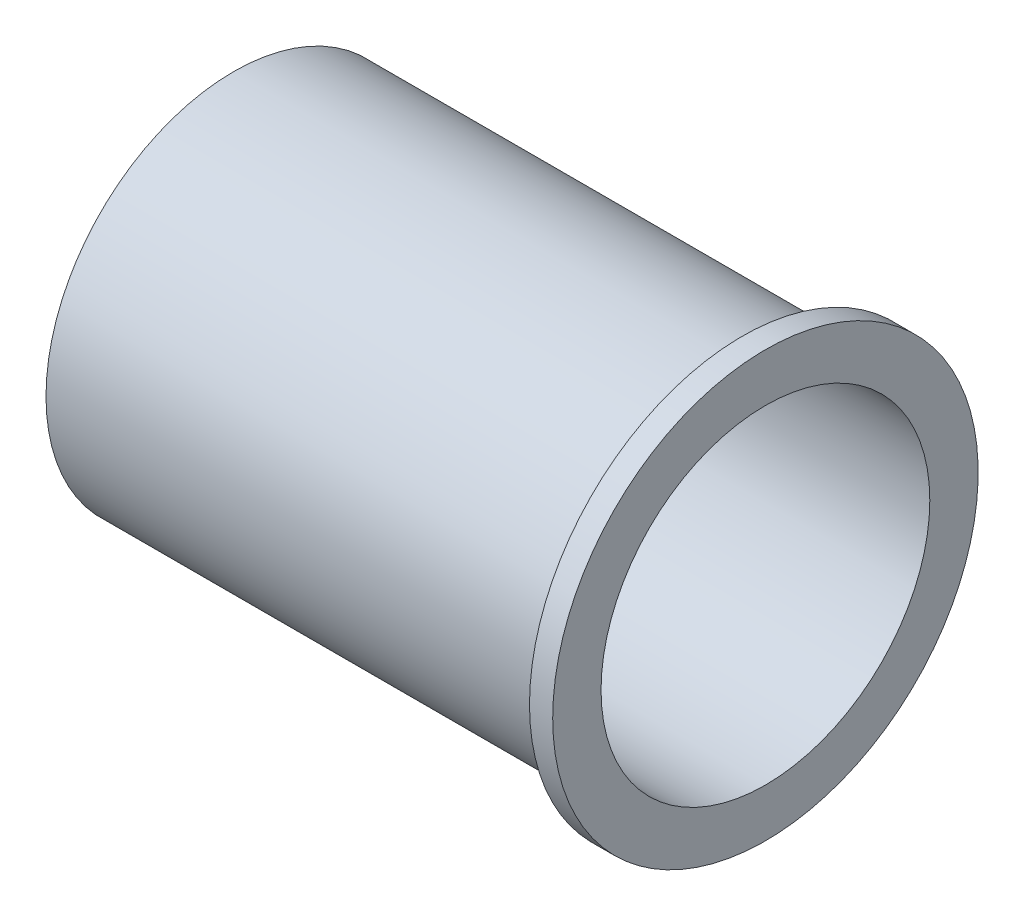
ISO-10303-21;
HEADER;
FILE_DESCRIPTION(('STEP AP214'),'2;1');
FILE_NAME('part.step','',(''),(''),'','','');
FILE_SCHEMA(('AUTOMOTIVE_DESIGN { 1 0 10303 214 1 1 1 1 }'));
ENDSEC;
DATA;
#1=APPLICATION_CONTEXT('core data for automotive mechanical design processes');
#2=APPLICATION_PROTOCOL_DEFINITION('international standard','automotive_design',2000,#1);
#3=PRODUCT_CONTEXT('',#1,'mechanical');
#4=PRODUCT('Part','Part','',(#3));
#5=PRODUCT_RELATED_PRODUCT_CATEGORY('part','',(#4));
#6=PRODUCT_DEFINITION_FORMATION('','',#4);
#7=PRODUCT_DEFINITION_CONTEXT('part definition',#1,'design');
#8=PRODUCT_DEFINITION('design','',#6,#7);
#9=PRODUCT_DEFINITION_SHAPE('','',#8);
#10=(LENGTH_UNIT() NAMED_UNIT(*) SI_UNIT(.MILLI.,.METRE.));
#11=(NAMED_UNIT(*) PLANE_ANGLE_UNIT() SI_UNIT($,.RADIAN.));
#12=(NAMED_UNIT(*) SI_UNIT($,.STERADIAN.) SOLID_ANGLE_UNIT());
#13=UNCERTAINTY_MEASURE_WITH_UNIT(LENGTH_MEASURE(1.E-05),#10,'distance_accuracy_value','');
#14=(GEOMETRIC_REPRESENTATION_CONTEXT(3) GLOBAL_UNCERTAINTY_ASSIGNED_CONTEXT((#13)) GLOBAL_UNIT_ASSIGNED_CONTEXT((#10,
#11,#12)) REPRESENTATION_CONTEXT('',''));
#15=CARTESIAN_POINT('',(0.,0.,0.));
#16=DIRECTION('',(0.,0.,1.));
#17=DIRECTION('',(1.,0.,0.));
#18=AXIS2_PLACEMENT_3D('',#15,#16,#17);
#19=CARTESIAN_POINT('',(-137.5,48.5,0.));
#20=DIRECTION('',(1.,0.,0.));
#21=DIRECTION('',(0.,0.,-1.));
#22=AXIS2_PLACEMENT_3D('',#19,#20,#21);
#23=PLANE('',#22);
#24=CARTESIAN_POINT('',(-137.5,0.,0.));
#25=DIRECTION('',(-1.,0.,0.));
#26=DIRECTION('',(0.,0.,1.));
#27=AXIS2_PLACEMENT_3D('',#24,#25,#26);
#28=CIRCLE('',#27,42.5);
#29=CARTESIAN_POINT('',(-137.5,0.,42.5));
#30=VERTEX_POINT('',#29);
#31=EDGE_CURVE('E10',#30,#30,#28,.T.);
#32=ORIENTED_EDGE('',*,*,#31,.F.);
#33=EDGE_LOOP('',(#32));
#34=FACE_BOUND('',#33,.T.);
#35=CARTESIAN_POINT('',(-137.5,0.,0.));
#36=DIRECTION('',(-1.,0.,0.));
#37=DIRECTION('',(0.,0.,1.));
#38=AXIS2_PLACEMENT_3D('',#35,#36,#37);
#39=CIRCLE('',#38,48.5);
#40=CARTESIAN_POINT('',(-137.5,0.,48.5));
#41=VERTEX_POINT('',#40);
#42=EDGE_CURVE('E55',#41,#41,#39,.T.);
#43=ORIENTED_EDGE('',*,*,#42,.T.);
#44=EDGE_LOOP('',(#43));
#45=FACE_BOUND('',#44,.T.);
#46=ADVANCED_FACE('F33',(#34,#45),#23,.F.);
#47=CARTESIAN_POINT('',(-94.8899371069183,0.,0.));
#48=DIRECTION('',(-1.,0.,0.));
#49=DIRECTION('',(0.,0.,1.));
#50=AXIS2_PLACEMENT_3D('',#47,#48,#49);
#51=CYLINDRICAL_SURFACE('',#50,42.5);
#52=CARTESIAN_POINT('',(0.,0.,0.));
#53=DIRECTION('',(-1.,0.,0.));
#54=DIRECTION('',(0.,0.,1.));
#55=AXIS2_PLACEMENT_3D('',#52,#53,#54);
#56=CIRCLE('',#55,42.5);
#57=CARTESIAN_POINT('',(0.,0.,42.5));
#58=VERTEX_POINT('',#57);
#59=EDGE_CURVE('E39',#58,#58,#56,.T.);
#60=ORIENTED_EDGE('',*,*,#59,.F.);
#61=EDGE_LOOP('',(#60));
#62=FACE_BOUND('',#61,.T.);
#63=ORIENTED_EDGE('',*,*,#31,.T.);
#64=EDGE_LOOP('',(#63));
#65=FACE_BOUND('',#64,.T.);
#66=ADVANCED_FACE('F80',(#62,#65),#51,.F.);
#67=CARTESIAN_POINT('',(0.,42.5,0.));
#68=DIRECTION('',(-1.,0.,0.));
#69=DIRECTION('',(0.,0.,1.));
#70=AXIS2_PLACEMENT_3D('',#67,#68,#69);
#71=PLANE('',#70);
#72=CARTESIAN_POINT('',(0.,0.,0.));
#73=DIRECTION('',(-1.,0.,0.));
#74=DIRECTION('',(0.,0.,1.));
#75=AXIS2_PLACEMENT_3D('',#72,#73,#74);
#76=CIRCLE('',#75,55.);
#77=CARTESIAN_POINT('',(0.,0.,55.));
#78=VERTEX_POINT('',#77);
#79=EDGE_CURVE('E43',#78,#78,#76,.T.);
#80=ORIENTED_EDGE('',*,*,#79,.F.);
#81=EDGE_LOOP('',(#80));
#82=FACE_BOUND('',#81,.T.);
#83=ORIENTED_EDGE('',*,*,#59,.T.);
#84=EDGE_LOOP('',(#83));
#85=FACE_BOUND('',#84,.T.);
#86=ADVANCED_FACE('F75',(#82,#85),#71,.F.);
#87=CARTESIAN_POINT('',(-94.8899371069183,0.,0.));
#88=DIRECTION('',(-1.,0.,0.));
#89=DIRECTION('',(0.,0.,1.));
#90=AXIS2_PLACEMENT_3D('',#87,#88,#89);
#91=CYLINDRICAL_SURFACE('',#90,55.);
#92=CARTESIAN_POINT('',(-5.99999999999999,0.,0.));
#93=DIRECTION('',(-1.,0.,0.));
#94=DIRECTION('',(0.,0.,1.));
#95=AXIS2_PLACEMENT_3D('',#92,#93,#94);
#96=CIRCLE('',#95,55.);
#97=CARTESIAN_POINT('',(-5.99999999999999,0.,55.));
#98=VERTEX_POINT('',#97);
#99=EDGE_CURVE('E47',#98,#98,#96,.T.);
#100=ORIENTED_EDGE('',*,*,#99,.F.);
#101=EDGE_LOOP('',(#100));
#102=FACE_BOUND('',#101,.T.);
#103=ORIENTED_EDGE('',*,*,#79,.T.);
#104=EDGE_LOOP('',(#103));
#105=FACE_BOUND('',#104,.T.);
#106=ADVANCED_FACE('F69',(#102,#105),#91,.T.);
#107=CARTESIAN_POINT('',(-5.99999999999999,48.5,0.));
#108=DIRECTION('',(1.,0.,0.));
#109=DIRECTION('',(0.,0.,-1.));
#110=AXIS2_PLACEMENT_3D('',#107,#108,#109);
#111=PLANE('',#110);
#112=CARTESIAN_POINT('',(-5.99999999999999,0.,0.));
#113=DIRECTION('',(-1.,0.,0.));
#114=DIRECTION('',(0.,0.,1.));
#115=AXIS2_PLACEMENT_3D('',#112,#113,#114);
#116=CIRCLE('',#115,48.5);
#117=CARTESIAN_POINT('',(-5.99999999999999,0.,48.5));
#118=VERTEX_POINT('',#117);
#119=EDGE_CURVE('E52',#118,#118,#116,.T.);
#120=ORIENTED_EDGE('',*,*,#119,.F.);
#121=EDGE_LOOP('',(#120));
#122=FACE_BOUND('',#121,.T.);
#123=ORIENTED_EDGE('',*,*,#99,.T.);
#124=EDGE_LOOP('',(#123));
#125=FACE_BOUND('',#124,.T.);
#126=ADVANCED_FACE('F63',(#122,#125),#111,.F.);
#127=CARTESIAN_POINT('',(-94.8899371069183,0.,0.));
#128=DIRECTION('',(-1.,0.,0.));
#129=DIRECTION('',(0.,0.,1.));
#130=AXIS2_PLACEMENT_3D('',#127,#128,#129);
#131=CYLINDRICAL_SURFACE('',#130,48.5);
#132=ORIENTED_EDGE('',*,*,#42,.F.);
#133=EDGE_LOOP('',(#132));
#134=FACE_BOUND('',#133,.T.);
#135=ORIENTED_EDGE('',*,*,#119,.T.);
#136=EDGE_LOOP('',(#135));
#137=FACE_BOUND('',#136,.T.);
#138=ADVANCED_FACE('F60',(#134,#137),#131,.T.);
#139=CLOSED_SHELL('',(#46,#66,#86,#106,#126,#138));
#140=MANIFOLD_SOLID_BREP('B2',#139);
#141=ADVANCED_BREP_SHAPE_REPRESENTATION('',(#18,#140),#14);
#142=SHAPE_DEFINITION_REPRESENTATION(#9,#141);
ENDSEC;
END-ISO-10303-21;
